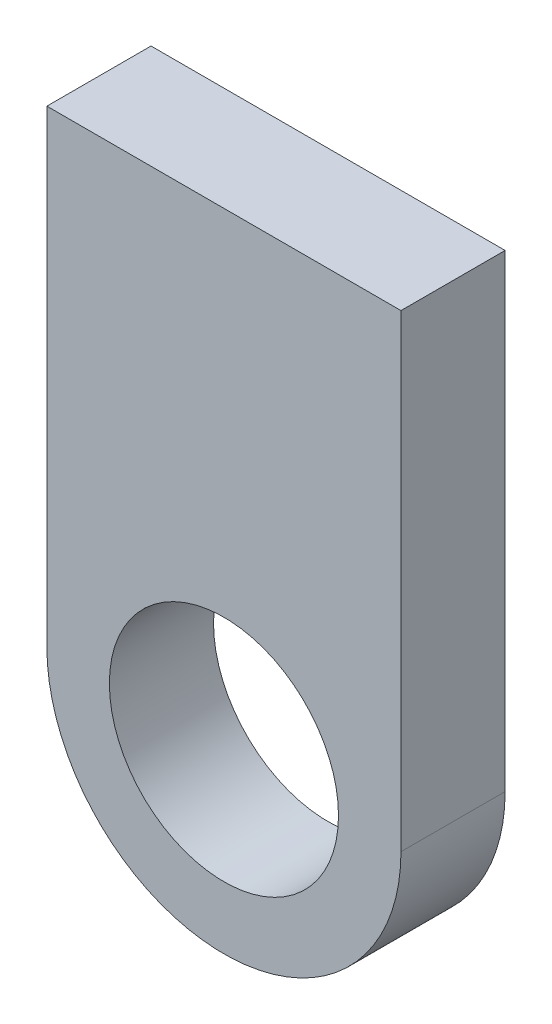
ISO-10303-21;
HEADER;
FILE_DESCRIPTION(('STEP AP214'),'2;1');
FILE_NAME('part.step','',(''),(''),'','','');
FILE_SCHEMA(('AUTOMOTIVE_DESIGN { 1 0 10303 214 1 1 1 1 }'));
ENDSEC;
DATA;
#1=APPLICATION_CONTEXT('core data for automotive mechanical design processes');
#2=APPLICATION_PROTOCOL_DEFINITION('international standard','automotive_design',2000,#1);
#3=PRODUCT_CONTEXT('',#1,'mechanical');
#4=PRODUCT('Part','Part','',(#3));
#5=PRODUCT_RELATED_PRODUCT_CATEGORY('part','',(#4));
#6=PRODUCT_DEFINITION_FORMATION('','',#4);
#7=PRODUCT_DEFINITION_CONTEXT('part definition',#1,'design');
#8=PRODUCT_DEFINITION('design','',#6,#7);
#9=PRODUCT_DEFINITION_SHAPE('','',#8);
#10=(LENGTH_UNIT() NAMED_UNIT(*) SI_UNIT(.MILLI.,.METRE.));
#11=(NAMED_UNIT(*) PLANE_ANGLE_UNIT() SI_UNIT($,.RADIAN.));
#12=(NAMED_UNIT(*) SI_UNIT($,.STERADIAN.) SOLID_ANGLE_UNIT());
#13=UNCERTAINTY_MEASURE_WITH_UNIT(LENGTH_MEASURE(1.E-05),#10,'distance_accuracy_value','');
#14=(GEOMETRIC_REPRESENTATION_CONTEXT(3) GLOBAL_UNCERTAINTY_ASSIGNED_CONTEXT((#13)) GLOBAL_UNIT_ASSIGNED_CONTEXT((#10,
#11,#12)) REPRESENTATION_CONTEXT('',''));
#15=CARTESIAN_POINT('',(0.,0.,0.));
#16=DIRECTION('',(0.,0.,1.));
#17=DIRECTION('',(1.,0.,0.));
#18=AXIS2_PLACEMENT_3D('',#15,#16,#17);
#19=CARTESIAN_POINT('',(0.,0.,0.5));
#20=DIRECTION('',(0.,0.,1.));
#21=DIRECTION('',(1.,0.,0.));
#22=AXIS2_PLACEMENT_3D('',#19,#20,#21);
#23=PLANE('',#22);
#24=DIRECTION('',(0.,-1.,0.));
#25=VECTOR('',#24,1.);
#26=CARTESIAN_POINT('',(-0.850000000000001,2.25,0.5));
#27=LINE('',#26,#25);
#28=CARTESIAN_POINT('',(-0.850000000000001,2.25,0.5));
#29=VERTEX_POINT('',#28);
#30=CARTESIAN_POINT('',(-0.85,0.,0.5));
#31=VERTEX_POINT('',#30);
#32=EDGE_CURVE('E85',#29,#31,#27,.T.);
#33=ORIENTED_EDGE('',*,*,#32,.T.);
#34=CARTESIAN_POINT('',(0.,0.,0.5));
#35=DIRECTION('',(0.,0.,1.));
#36=DIRECTION('',(1.,0.,0.));
#37=AXIS2_PLACEMENT_3D('',#34,#35,#36);
#38=CIRCLE('',#37,0.85);
#39=CARTESIAN_POINT('',(0.85,0.,0.5));
#40=VERTEX_POINT('',#39);
#41=EDGE_CURVE('E80',#31,#40,#38,.T.);
#42=ORIENTED_EDGE('',*,*,#41,.T.);
#43=DIRECTION('',(0.,1.,0.));
#44=VECTOR('',#43,1.);
#45=CARTESIAN_POINT('',(0.849999999999999,2.25,0.5));
#46=LINE('',#45,#44);
#47=CARTESIAN_POINT('',(0.849999999999999,2.25,0.5));
#48=VERTEX_POINT('',#47);
#49=EDGE_CURVE('E83',#40,#48,#46,.T.);
#50=ORIENTED_EDGE('',*,*,#49,.T.);
#51=DIRECTION('',(-1.,0.,0.));
#52=VECTOR('',#51,1.);
#53=CARTESIAN_POINT('',(-0.850000000000001,2.25,0.5));
#54=LINE('',#53,#52);
#55=EDGE_CURVE('E50',#48,#29,#54,.T.);
#56=ORIENTED_EDGE('',*,*,#55,.T.);
#57=EDGE_LOOP('',(#33,#42,#50,#56));
#58=FACE_BOUND('',#57,.T.);
#59=CARTESIAN_POINT('',(0.,0.,0.5));
#60=DIRECTION('',(0.,0.,1.));
#61=DIRECTION('',(1.,0.,0.));
#62=AXIS2_PLACEMENT_3D('',#59,#60,#61);
#63=CIRCLE('',#62,0.55);
#64=CARTESIAN_POINT('',(0.55,0.,0.5));
#65=VERTEX_POINT('',#64);
#66=EDGE_CURVE('E100',#65,#65,#63,.T.);
#67=ORIENTED_EDGE('',*,*,#66,.F.);
#68=EDGE_LOOP('',(#67));
#69=FACE_BOUND('',#68,.T.);
#70=ADVANCED_FACE('F33',(#58,#69),#23,.T.);
#71=CARTESIAN_POINT('',(0.,0.,0.));
#72=DIRECTION('',(0.,0.,1.));
#73=DIRECTION('',(1.,0.,0.));
#74=AXIS2_PLACEMENT_3D('',#71,#72,#73);
#75=PLANE('',#74);
#76=DIRECTION('',(0.,-1.,0.));
#77=VECTOR('',#76,1.);
#78=CARTESIAN_POINT('',(-0.850000000000001,2.25,0.));
#79=LINE('',#78,#77);
#80=CARTESIAN_POINT('',(-0.850000000000001,2.25,0.));
#81=VERTEX_POINT('',#80);
#82=CARTESIAN_POINT('',(-0.85,0.,0.));
#83=VERTEX_POINT('',#82);
#84=EDGE_CURVE('E97',#81,#83,#79,.T.);
#85=ORIENTED_EDGE('',*,*,#84,.F.);
#86=DIRECTION('',(-1.,0.,0.));
#87=VECTOR('',#86,1.);
#88=CARTESIAN_POINT('',(-0.850000000000001,2.25,0.));
#89=LINE('',#88,#87);
#90=CARTESIAN_POINT('',(0.849999999999999,2.25,0.));
#91=VERTEX_POINT('',#90);
#92=EDGE_CURVE('E73',#91,#81,#89,.T.);
#93=ORIENTED_EDGE('',*,*,#92,.F.);
#94=DIRECTION('',(0.,1.,0.));
#95=VECTOR('',#94,1.);
#96=CARTESIAN_POINT('',(0.849999999999999,2.25,0.));
#97=LINE('',#96,#95);
#98=CARTESIAN_POINT('',(0.85,0.,0.));
#99=VERTEX_POINT('',#98);
#100=EDGE_CURVE('E67',#99,#91,#97,.T.);
#101=ORIENTED_EDGE('',*,*,#100,.F.);
#102=CARTESIAN_POINT('',(0.,0.,0.));
#103=DIRECTION('',(0.,0.,1.));
#104=DIRECTION('',(1.,0.,0.));
#105=AXIS2_PLACEMENT_3D('',#102,#103,#104);
#106=CIRCLE('',#105,0.85);
#107=EDGE_CURVE('E89',#83,#99,#106,.T.);
#108=ORIENTED_EDGE('',*,*,#107,.F.);
#109=EDGE_LOOP('',(#85,#93,#101,#108));
#110=FACE_BOUND('',#109,.T.);
#111=CARTESIAN_POINT('',(0.,0.,0.));
#112=DIRECTION('',(0.,0.,1.));
#113=DIRECTION('',(1.,0.,0.));
#114=AXIS2_PLACEMENT_3D('',#111,#112,#113);
#115=CIRCLE('',#114,0.55);
#116=CARTESIAN_POINT('',(0.55,0.,0.));
#117=VERTEX_POINT('',#116);
#118=EDGE_CURVE('E112',#117,#117,#115,.T.);
#119=ORIENTED_EDGE('',*,*,#118,.T.);
#120=EDGE_LOOP('',(#119));
#121=FACE_BOUND('',#120,.T.);
#122=ADVANCED_FACE('F108',(#110,#121),#75,.F.);
#123=CARTESIAN_POINT('',(-0.850000000000001,2.25,0.5));
#124=DIRECTION('',(1.,0.,0.));
#125=DIRECTION('',(0.,1.,0.));
#126=AXIS2_PLACEMENT_3D('',#123,#124,#125);
#127=PLANE('',#126);
#128=ORIENTED_EDGE('',*,*,#84,.T.);
#129=DIRECTION('',(0.,0.,-1.));
#130=VECTOR('',#129,1.);
#131=CARTESIAN_POINT('',(-0.85,0.,0.5));
#132=LINE('',#131,#130);
#133=EDGE_CURVE('E11',#31,#83,#132,.T.);
#134=ORIENTED_EDGE('',*,*,#133,.F.);
#135=ORIENTED_EDGE('',*,*,#32,.F.);
#136=DIRECTION('',(0.,0.,-1.));
#137=VECTOR('',#136,1.);
#138=CARTESIAN_POINT('',(-0.850000000000001,2.25,0.5));
#139=LINE('',#138,#137);
#140=EDGE_CURVE('E93',#29,#81,#139,.T.);
#141=ORIENTED_EDGE('',*,*,#140,.T.);
#142=EDGE_LOOP('',(#128,#134,#135,#141));
#143=FACE_BOUND('',#142,.T.);
#144=ADVANCED_FACE('F35',(#143),#127,.F.);
#145=CARTESIAN_POINT('',(0.,0.,0.5));
#146=DIRECTION('',(0.,0.,-1.));
#147=DIRECTION('',(-1.,0.,0.));
#148=AXIS2_PLACEMENT_3D('',#145,#146,#147);
#149=CYLINDRICAL_SURFACE('',#148,0.85);
#150=ORIENTED_EDGE('',*,*,#107,.T.);
#151=DIRECTION('',(0.,0.,-1.));
#152=VECTOR('',#151,1.);
#153=CARTESIAN_POINT('',(0.85,0.,0.5));
#154=LINE('',#153,#152);
#155=EDGE_CURVE('E42',#40,#99,#154,.T.);
#156=ORIENTED_EDGE('',*,*,#155,.F.);
#157=ORIENTED_EDGE('',*,*,#41,.F.);
#158=ORIENTED_EDGE('',*,*,#133,.T.);
#159=EDGE_LOOP('',(#150,#156,#157,#158));
#160=FACE_BOUND('',#159,.T.);
#161=ADVANCED_FACE('F88',(#160),#149,.T.);
#162=CARTESIAN_POINT('',(0.849999999999999,2.25,0.5));
#163=DIRECTION('',(-1.,0.,0.));
#164=DIRECTION('',(0.,-1.,0.));
#165=AXIS2_PLACEMENT_3D('',#162,#163,#164);
#166=PLANE('',#165);
#167=ORIENTED_EDGE('',*,*,#100,.T.);
#168=DIRECTION('',(0.,0.,-1.));
#169=VECTOR('',#168,1.);
#170=CARTESIAN_POINT('',(0.849999999999999,2.25,0.5));
#171=LINE('',#170,#169);
#172=EDGE_CURVE('E90',#48,#91,#171,.T.);
#173=ORIENTED_EDGE('',*,*,#172,.F.);
#174=ORIENTED_EDGE('',*,*,#49,.F.);
#175=ORIENTED_EDGE('',*,*,#155,.T.);
#176=EDGE_LOOP('',(#167,#173,#174,#175));
#177=FACE_BOUND('',#176,.T.);
#178=ADVANCED_FACE('F91',(#177),#166,.F.);
#179=CARTESIAN_POINT('',(-0.850000000000001,2.25,0.5));
#180=DIRECTION('',(0.,-1.,0.));
#181=DIRECTION('',(1.,0.,0.));
#182=AXIS2_PLACEMENT_3D('',#179,#180,#181);
#183=PLANE('',#182);
#184=ORIENTED_EDGE('',*,*,#92,.T.);
#185=ORIENTED_EDGE('',*,*,#140,.F.);
#186=ORIENTED_EDGE('',*,*,#55,.F.);
#187=ORIENTED_EDGE('',*,*,#172,.T.);
#188=EDGE_LOOP('',(#184,#185,#186,#187));
#189=FACE_BOUND('',#188,.T.);
#190=ADVANCED_FACE('F105',(#189),#183,.F.);
#191=CARTESIAN_POINT('',(0.,0.,0.5));
#192=DIRECTION('',(0.,0.,-1.));
#193=DIRECTION('',(-1.,0.,0.));
#194=AXIS2_PLACEMENT_3D('',#191,#192,#193);
#195=CYLINDRICAL_SURFACE('',#194,0.55);
#196=ORIENTED_EDGE('',*,*,#66,.T.);
#197=EDGE_LOOP('',(#196));
#198=FACE_BOUND('',#197,.T.);
#199=ORIENTED_EDGE('',*,*,#118,.F.);
#200=EDGE_LOOP('',(#199));
#201=FACE_BOUND('',#200,.T.);
#202=ADVANCED_FACE('F118',(#198,#201),#195,.F.);
#203=CLOSED_SHELL('',(#70,#122,#144,#161,#178,#190,#202));
#204=MANIFOLD_SOLID_BREP('B2',#203);
#205=ADVANCED_BREP_SHAPE_REPRESENTATION('',(#18,#204),#14);
#206=SHAPE_DEFINITION_REPRESENTATION(#9,#205);
ENDSEC;
END-ISO-10303-21;
